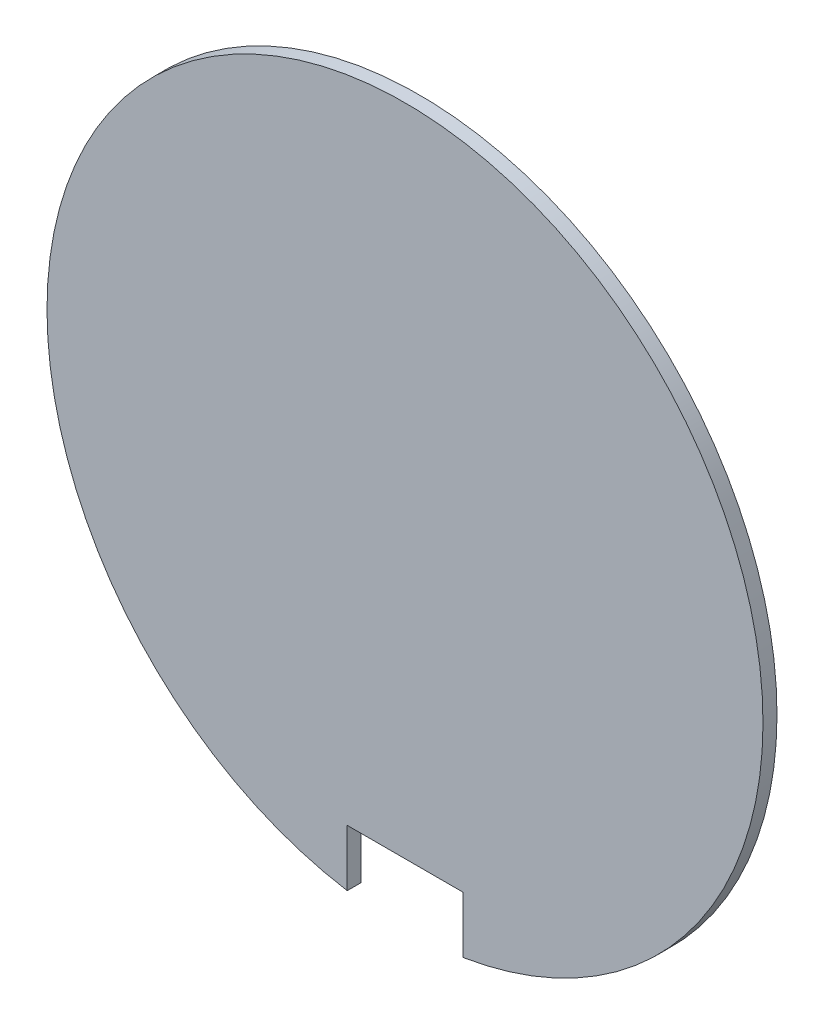
ISO-10303-21;
HEADER;
FILE_DESCRIPTION(('STEP AP214'),'2;1');
FILE_NAME('part.step','',(''),(''),'','','');
FILE_SCHEMA(('AUTOMOTIVE_DESIGN { 1 0 10303 214 1 1 1 1 }'));
ENDSEC;
DATA;
#1=APPLICATION_CONTEXT('core data for automotive mechanical design processes');
#2=APPLICATION_PROTOCOL_DEFINITION('international standard','automotive_design',2000,#1);
#3=PRODUCT_CONTEXT('',#1,'mechanical');
#4=PRODUCT('Part','Part','',(#3));
#5=PRODUCT_RELATED_PRODUCT_CATEGORY('part','',(#4));
#6=PRODUCT_DEFINITION_FORMATION('','',#4);
#7=PRODUCT_DEFINITION_CONTEXT('part definition',#1,'design');
#8=PRODUCT_DEFINITION('design','',#6,#7);
#9=PRODUCT_DEFINITION_SHAPE('','',#8);
#10=(LENGTH_UNIT() NAMED_UNIT(*) SI_UNIT(.MILLI.,.METRE.));
#11=(NAMED_UNIT(*) PLANE_ANGLE_UNIT() SI_UNIT($,.RADIAN.));
#12=(NAMED_UNIT(*) SI_UNIT($,.STERADIAN.) SOLID_ANGLE_UNIT());
#13=UNCERTAINTY_MEASURE_WITH_UNIT(LENGTH_MEASURE(1.E-05),#10,'distance_accuracy_value','');
#14=(GEOMETRIC_REPRESENTATION_CONTEXT(3) GLOBAL_UNCERTAINTY_ASSIGNED_CONTEXT((#13)) GLOBAL_UNIT_ASSIGNED_CONTEXT((#10,
#11,#12)) REPRESENTATION_CONTEXT('',''));
#15=CARTESIAN_POINT('',(0.,0.,0.));
#16=DIRECTION('',(0.,0.,1.));
#17=DIRECTION('',(1.,0.,0.));
#18=AXIS2_PLACEMENT_3D('',#15,#16,#17);
#19=CARTESIAN_POINT('',(0.,0.,0.4064));
#20=DIRECTION('',(0.,0.,-1.));
#21=DIRECTION('',(-1.,0.,0.));
#22=AXIS2_PLACEMENT_3D('',#19,#20,#21);
#23=CYLINDRICAL_SURFACE('',#22,10.3886);
#24=CARTESIAN_POINT('',(0.,0.,0.));
#25=DIRECTION('',(0.,0.,1.));
#26=DIRECTION('',(1.,0.,0.));
#27=AXIS2_PLACEMENT_3D('',#24,#25,#26);
#28=CIRCLE('',#27,10.3886);
#29=CARTESIAN_POINT('',(1.67640000000003,-10.2524481466623,0.));
#30=VERTEX_POINT('',#29);
#31=CARTESIAN_POINT('',(-1.67639999999997,-10.2524481466623,0.));
#32=VERTEX_POINT('',#31);
#33=EDGE_CURVE('E108',#30,#32,#28,.T.);
#34=ORIENTED_EDGE('',*,*,#33,.T.);
#35=DIRECTION('',(0.,0.,-1.));
#36=VECTOR('',#35,1.);
#37=CARTESIAN_POINT('',(-1.67639999999997,-10.2524481466623,0.4064));
#38=LINE('',#37,#36);
#39=CARTESIAN_POINT('',(-1.67639999999997,-10.2524481466623,0.4064));
#40=VERTEX_POINT('',#39);
#41=EDGE_CURVE('E11',#40,#32,#38,.T.);
#42=ORIENTED_EDGE('',*,*,#41,.F.);
#43=CARTESIAN_POINT('',(0.,0.,0.4064));
#44=DIRECTION('',(0.,0.,1.));
#45=DIRECTION('',(1.,0.,0.));
#46=AXIS2_PLACEMENT_3D('',#43,#44,#45);
#47=CIRCLE('',#46,10.3886);
#48=CARTESIAN_POINT('',(1.67640000000003,-10.2524481466623,0.4064));
#49=VERTEX_POINT('',#48);
#50=EDGE_CURVE('E85',#49,#40,#47,.T.);
#51=ORIENTED_EDGE('',*,*,#50,.F.);
#52=DIRECTION('',(0.,0.,-1.));
#53=VECTOR('',#52,1.);
#54=CARTESIAN_POINT('',(1.67640000000003,-10.2524481466623,0.4064));
#55=LINE('',#54,#53);
#56=EDGE_CURVE('E61',#49,#30,#55,.T.);
#57=ORIENTED_EDGE('',*,*,#56,.T.);
#58=EDGE_LOOP('',(#34,#42,#51,#57));
#59=FACE_BOUND('',#58,.T.);
#60=ADVANCED_FACE('F45',(#59),#23,.T.);
#61=CARTESIAN_POINT('',(-1.67639999999997,-8.61059999999998,0.4064));
#62=DIRECTION('',(1.,0.,0.));
#63=DIRECTION('',(0.,1.,0.));
#64=AXIS2_PLACEMENT_3D('',#61,#62,#63);
#65=PLANE('',#64);
#66=DIRECTION('',(0.,-1.,0.));
#67=VECTOR('',#66,1.);
#68=CARTESIAN_POINT('',(-1.67639999999997,-8.61059999999998,0.));
#69=LINE('',#68,#67);
#70=CARTESIAN_POINT('',(-1.67639999999997,-8.61059999999998,0.));
#71=VERTEX_POINT('',#70);
#72=EDGE_CURVE('E94',#71,#32,#69,.T.);
#73=ORIENTED_EDGE('',*,*,#72,.F.);
#74=DIRECTION('',(0.,0.,-1.));
#75=VECTOR('',#74,1.);
#76=CARTESIAN_POINT('',(-1.67639999999997,-8.61059999999998,0.4064));
#77=LINE('',#76,#75);
#78=CARTESIAN_POINT('',(-1.67639999999997,-8.61059999999998,0.4064));
#79=VERTEX_POINT('',#78);
#80=EDGE_CURVE('E53',#79,#71,#77,.T.);
#81=ORIENTED_EDGE('',*,*,#80,.F.);
#82=DIRECTION('',(0.,-1.,0.));
#83=VECTOR('',#82,1.);
#84=CARTESIAN_POINT('',(-1.67639999999997,-8.61059999999998,0.4064));
#85=LINE('',#84,#83);
#86=EDGE_CURVE('E92',#79,#40,#85,.T.);
#87=ORIENTED_EDGE('',*,*,#86,.T.);
#88=ORIENTED_EDGE('',*,*,#41,.T.);
#89=EDGE_LOOP('',(#73,#81,#87,#88));
#90=FACE_BOUND('',#89,.T.);
#91=ADVANCED_FACE('F91',(#90),#65,.T.);
#92=CARTESIAN_POINT('',(1.67640000000003,-8.61059999999998,0.4064));
#93=DIRECTION('',(0.,-1.,0.));
#94=DIRECTION('',(0.,0.,-1.));
#95=AXIS2_PLACEMENT_3D('',#92,#93,#94);
#96=PLANE('',#95);
#97=DIRECTION('',(-1.,0.,0.));
#98=VECTOR('',#97,1.);
#99=CARTESIAN_POINT('',(1.67640000000003,-8.61059999999998,0.));
#100=LINE('',#99,#98);
#101=CARTESIAN_POINT('',(1.67640000000003,-8.61059999999998,0.));
#102=VERTEX_POINT('',#101);
#103=EDGE_CURVE('E111',#102,#71,#100,.T.);
#104=ORIENTED_EDGE('',*,*,#103,.F.);
#105=DIRECTION('',(0.,0.,-1.));
#106=VECTOR('',#105,1.);
#107=CARTESIAN_POINT('',(1.67640000000003,-8.61059999999998,0.4064));
#108=LINE('',#107,#106);
#109=CARTESIAN_POINT('',(1.67640000000003,-8.61059999999998,0.4064));
#110=VERTEX_POINT('',#109);
#111=EDGE_CURVE('E74',#110,#102,#108,.T.);
#112=ORIENTED_EDGE('',*,*,#111,.F.);
#113=DIRECTION('',(-1.,0.,0.));
#114=VECTOR('',#113,1.);
#115=CARTESIAN_POINT('',(1.67640000000003,-8.61059999999998,0.4064));
#116=LINE('',#115,#114);
#117=EDGE_CURVE('E100',#110,#79,#116,.T.);
#118=ORIENTED_EDGE('',*,*,#117,.T.);
#119=ORIENTED_EDGE('',*,*,#80,.T.);
#120=EDGE_LOOP('',(#104,#112,#118,#119));
#121=FACE_BOUND('',#120,.T.);
#122=ADVANCED_FACE('F102',(#121),#96,.T.);
#123=CARTESIAN_POINT('',(1.67640000000003,-10.2524481466623,0.4064));
#124=DIRECTION('',(-1.,0.,0.));
#125=DIRECTION('',(0.,-1.,0.));
#126=AXIS2_PLACEMENT_3D('',#123,#124,#125);
#127=PLANE('',#126);
#128=DIRECTION('',(0.,1.,0.));
#129=VECTOR('',#128,1.);
#130=CARTESIAN_POINT('',(1.67640000000003,-10.2524481466623,0.));
#131=LINE('',#130,#129);
#132=EDGE_CURVE('E113',#30,#102,#131,.T.);
#133=ORIENTED_EDGE('',*,*,#132,.F.);
#134=ORIENTED_EDGE('',*,*,#56,.F.);
#135=DIRECTION('',(0.,1.,0.));
#136=VECTOR('',#135,1.);
#137=CARTESIAN_POINT('',(1.67640000000003,-10.2524481466623,0.4064));
#138=LINE('',#137,#136);
#139=EDGE_CURVE('E103',#49,#110,#138,.T.);
#140=ORIENTED_EDGE('',*,*,#139,.T.);
#141=ORIENTED_EDGE('',*,*,#111,.T.);
#142=EDGE_LOOP('',(#133,#134,#140,#141));
#143=FACE_BOUND('',#142,.T.);
#144=ADVANCED_FACE('F119',(#143),#127,.T.);
#145=CARTESIAN_POINT('',(0.,0.,0.4064));
#146=DIRECTION('',(0.,0.,1.));
#147=DIRECTION('',(1.,0.,0.));
#148=AXIS2_PLACEMENT_3D('',#145,#146,#147);
#149=PLANE('',#148);
#150=ORIENTED_EDGE('',*,*,#50,.T.);
#151=ORIENTED_EDGE('',*,*,#86,.F.);
#152=ORIENTED_EDGE('',*,*,#117,.F.);
#153=ORIENTED_EDGE('',*,*,#139,.F.);
#154=EDGE_LOOP('',(#150,#151,#152,#153));
#155=FACE_BOUND('',#154,.T.);
#156=ADVANCED_FACE('F99',(#155),#149,.T.);
#157=CARTESIAN_POINT('',(0.,0.,0.));
#158=DIRECTION('',(0.,0.,1.));
#159=DIRECTION('',(1.,0.,0.));
#160=AXIS2_PLACEMENT_3D('',#157,#158,#159);
#161=PLANE('',#160);
#162=ORIENTED_EDGE('',*,*,#33,.F.);
#163=ORIENTED_EDGE('',*,*,#132,.T.);
#164=ORIENTED_EDGE('',*,*,#103,.T.);
#165=ORIENTED_EDGE('',*,*,#72,.T.);
#166=EDGE_LOOP('',(#162,#163,#164,#165));
#167=FACE_BOUND('',#166,.T.);
#168=ADVANCED_FACE('F118',(#167),#161,.F.);
#169=CLOSED_SHELL('',(#60,#91,#122,#144,#156,#168));
#170=MANIFOLD_SOLID_BREP('B2',#169);
#171=ADVANCED_BREP_SHAPE_REPRESENTATION('',(#18,#170),#14);
#172=SHAPE_DEFINITION_REPRESENTATION(#9,#171);
ENDSEC;
END-ISO-10303-21;
